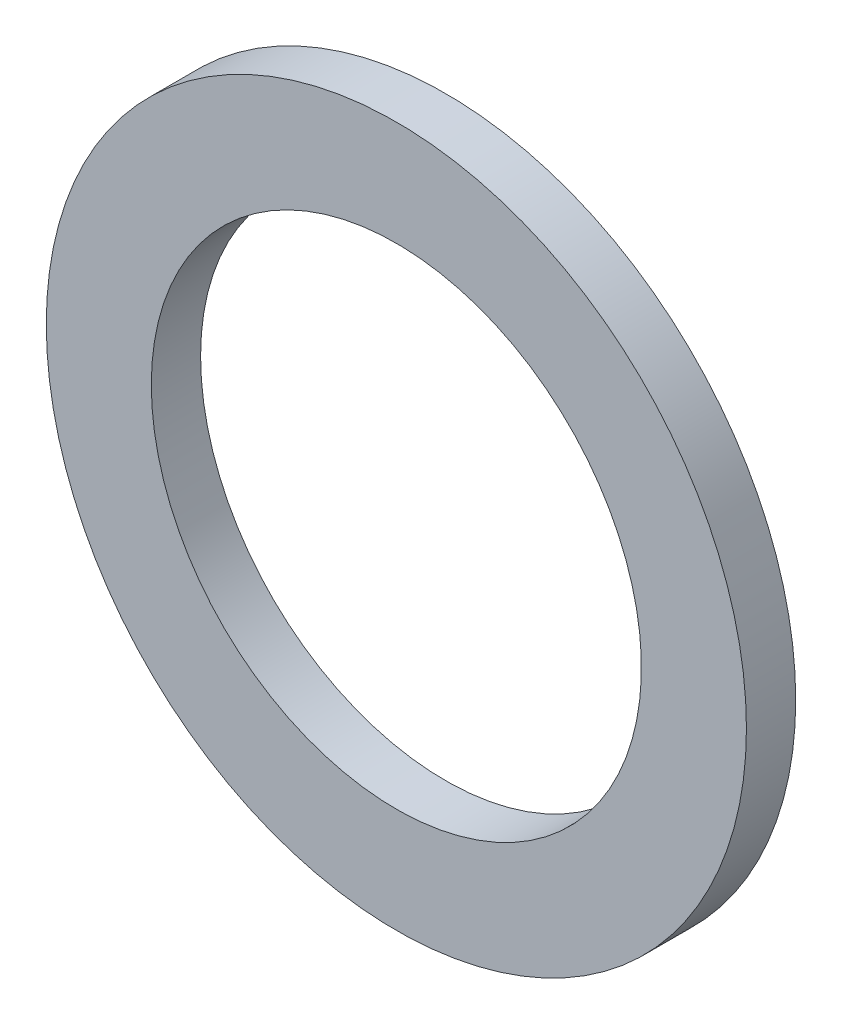
ISO-10303-21;
HEADER;
FILE_DESCRIPTION(('STEP AP214'),'2;1');
FILE_NAME('part.step','',(''),(''),'','','');
FILE_SCHEMA(('AUTOMOTIVE_DESIGN { 1 0 10303 214 1 1 1 1 }'));
ENDSEC;
DATA;
#1=APPLICATION_CONTEXT('core data for automotive mechanical design processes');
#2=APPLICATION_PROTOCOL_DEFINITION('international standard','automotive_design',2000,#1);
#3=PRODUCT_CONTEXT('',#1,'mechanical');
#4=PRODUCT('Part','Part','',(#3));
#5=PRODUCT_RELATED_PRODUCT_CATEGORY('part','',(#4));
#6=PRODUCT_DEFINITION_FORMATION('','',#4);
#7=PRODUCT_DEFINITION_CONTEXT('part definition',#1,'design');
#8=PRODUCT_DEFINITION('design','',#6,#7);
#9=PRODUCT_DEFINITION_SHAPE('','',#8);
#10=(LENGTH_UNIT() NAMED_UNIT(*) SI_UNIT(.MILLI.,.METRE.));
#11=(NAMED_UNIT(*) PLANE_ANGLE_UNIT() SI_UNIT($,.RADIAN.));
#12=(NAMED_UNIT(*) SI_UNIT($,.STERADIAN.) SOLID_ANGLE_UNIT());
#13=UNCERTAINTY_MEASURE_WITH_UNIT(LENGTH_MEASURE(1.E-05),#10,'distance_accuracy_value','');
#14=(GEOMETRIC_REPRESENTATION_CONTEXT(3) GLOBAL_UNCERTAINTY_ASSIGNED_CONTEXT((#13)) GLOBAL_UNIT_ASSIGNED_CONTEXT((#10,
#11,#12)) REPRESENTATION_CONTEXT('',''));
#15=CARTESIAN_POINT('',(0.,0.,0.));
#16=DIRECTION('',(0.,0.,1.));
#17=DIRECTION('',(1.,0.,0.));
#18=AXIS2_PLACEMENT_3D('',#15,#16,#17);
#19=CARTESIAN_POINT('',(0.,0.,-0.5588));
#20=DIRECTION('',(0.,0.,1.));
#21=DIRECTION('',(1.,0.,0.));
#22=AXIS2_PLACEMENT_3D('',#19,#20,#21);
#23=PLANE('',#22);
#24=CARTESIAN_POINT('',(0.,0.,-0.5588));
#25=DIRECTION('',(0.,0.,-1.));
#26=DIRECTION('',(-1.,0.,0.));
#27=AXIS2_PLACEMENT_3D('',#24,#25,#26);
#28=CIRCLE('',#27,5.55625);
#29=CARTESIAN_POINT('',(-5.55625,0.,-0.5588));
#30=VERTEX_POINT('',#29);
#31=EDGE_CURVE('E26',#30,#30,#28,.F.);
#32=ORIENTED_EDGE('',*,*,#31,.T.);
#33=EDGE_LOOP('',(#32));
#34=FACE_BOUND('',#33,.T.);
#35=CARTESIAN_POINT('',(0.,0.,-0.5588));
#36=DIRECTION('',(0.,0.,-1.));
#37=DIRECTION('',(-1.,0.,0.));
#38=AXIS2_PLACEMENT_3D('',#35,#36,#37);
#39=CIRCLE('',#38,7.9375);
#40=CARTESIAN_POINT('',(-7.9375,0.,-0.5588));
#41=VERTEX_POINT('',#40);
#42=EDGE_CURVE('E17',#41,#41,#39,.F.);
#43=ORIENTED_EDGE('',*,*,#42,.F.);
#44=EDGE_LOOP('',(#43));
#45=FACE_BOUND('',#44,.T.);
#46=ADVANCED_FACE('F14',(#34,#45),#23,.F.);
#47=CARTESIAN_POINT('',(0.,0.,0.5588));
#48=DIRECTION('',(0.,0.,-1.));
#49=DIRECTION('',(-1.,0.,0.));
#50=AXIS2_PLACEMENT_3D('',#47,#48,#49);
#51=CYLINDRICAL_SURFACE('',#50,7.9375);
#52=ORIENTED_EDGE('',*,*,#42,.T.);
#53=EDGE_LOOP('',(#52));
#54=FACE_BOUND('',#53,.T.);
#55=CARTESIAN_POINT('',(0.,0.,0.5588));
#56=DIRECTION('',(0.,0.,-1.));
#57=DIRECTION('',(-1.,0.,0.));
#58=AXIS2_PLACEMENT_3D('',#55,#56,#57);
#59=CIRCLE('',#58,7.9375);
#60=CARTESIAN_POINT('',(-7.9375,0.,0.5588));
#61=VERTEX_POINT('',#60);
#62=EDGE_CURVE('E21',#61,#61,#59,.F.);
#63=ORIENTED_EDGE('',*,*,#62,.F.);
#64=EDGE_LOOP('',(#63));
#65=FACE_BOUND('',#64,.T.);
#66=ADVANCED_FACE('F34',(#54,#65),#51,.T.);
#67=CARTESIAN_POINT('',(0.,0.,0.5588));
#68=DIRECTION('',(0.,0.,-1.));
#69=DIRECTION('',(-1.,0.,0.));
#70=AXIS2_PLACEMENT_3D('',#67,#68,#69);
#71=CYLINDRICAL_SURFACE('',#70,5.55625);
#72=CARTESIAN_POINT('',(0.,0.,0.5588));
#73=DIRECTION('',(0.,0.,-1.));
#74=DIRECTION('',(-1.,0.,0.));
#75=AXIS2_PLACEMENT_3D('',#72,#73,#74);
#76=CIRCLE('',#75,5.55625);
#77=CARTESIAN_POINT('',(-5.55625,0.,0.5588));
#78=VERTEX_POINT('',#77);
#79=EDGE_CURVE('E10',#78,#78,#76,.T.);
#80=ORIENTED_EDGE('',*,*,#79,.F.);
#81=EDGE_LOOP('',(#80));
#82=FACE_BOUND('',#81,.T.);
#83=ORIENTED_EDGE('',*,*,#31,.F.);
#84=EDGE_LOOP('',(#83));
#85=FACE_BOUND('',#84,.T.);
#86=ADVANCED_FACE('F42',(#82,#85),#71,.F.);
#87=CARTESIAN_POINT('',(0.,0.,0.5588));
#88=DIRECTION('',(0.,0.,1.));
#89=DIRECTION('',(1.,0.,0.));
#90=AXIS2_PLACEMENT_3D('',#87,#88,#89);
#91=PLANE('',#90);
#92=ORIENTED_EDGE('',*,*,#79,.T.);
#93=EDGE_LOOP('',(#92));
#94=FACE_BOUND('',#93,.T.);
#95=ORIENTED_EDGE('',*,*,#62,.T.);
#96=EDGE_LOOP('',(#95));
#97=FACE_BOUND('',#96,.T.);
#98=ADVANCED_FACE('F43',(#94,#97),#91,.T.);
#99=CLOSED_SHELL('',(#46,#66,#86,#98));
#100=MANIFOLD_SOLID_BREP('B1',#99);
#101=ADVANCED_BREP_SHAPE_REPRESENTATION('',(#18,#100),#14);
#102=SHAPE_DEFINITION_REPRESENTATION(#9,#101);
ENDSEC;
END-ISO-10303-21;
